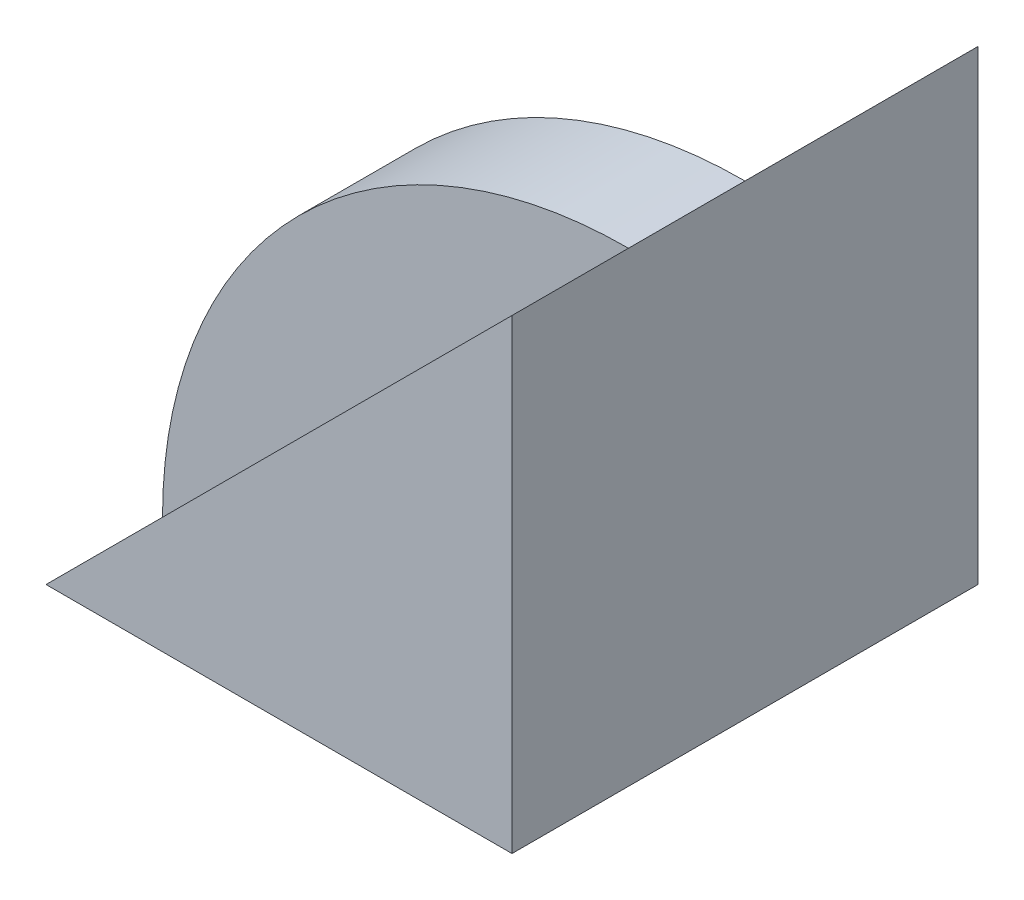
ISO-10303-21;
HEADER;
FILE_DESCRIPTION(('STEP AP214'),'2;1');
FILE_NAME('part.step','',(''),(''),'','','');
FILE_SCHEMA(('AUTOMOTIVE_DESIGN { 1 0 10303 214 1 1 1 1 }'));
ENDSEC;
DATA;
#1=APPLICATION_CONTEXT('core data for automotive mechanical design processes');
#2=APPLICATION_PROTOCOL_DEFINITION('international standard','automotive_design',2000,#1);
#3=PRODUCT_CONTEXT('',#1,'mechanical');
#4=PRODUCT('Part','Part','',(#3));
#5=PRODUCT_RELATED_PRODUCT_CATEGORY('part','',(#4));
#6=PRODUCT_DEFINITION_FORMATION('','',#4);
#7=PRODUCT_DEFINITION_CONTEXT('part definition',#1,'design');
#8=PRODUCT_DEFINITION('design','',#6,#7);
#9=PRODUCT_DEFINITION_SHAPE('','',#8);
#10=(LENGTH_UNIT() NAMED_UNIT(*) SI_UNIT(.MILLI.,.METRE.));
#11=(NAMED_UNIT(*) PLANE_ANGLE_UNIT() SI_UNIT($,.RADIAN.));
#12=(NAMED_UNIT(*) SI_UNIT($,.STERADIAN.) SOLID_ANGLE_UNIT());
#13=UNCERTAINTY_MEASURE_WITH_UNIT(LENGTH_MEASURE(1.E-05),#10,'distance_accuracy_value','');
#14=(GEOMETRIC_REPRESENTATION_CONTEXT(3) GLOBAL_UNCERTAINTY_ASSIGNED_CONTEXT((#13)) GLOBAL_UNIT_ASSIGNED_CONTEXT((#10,
#11,#12)) REPRESENTATION_CONTEXT('',''));
#15=CARTESIAN_POINT('',(0.,0.,0.));
#16=DIRECTION('',(0.,0.,1.));
#17=DIRECTION('',(1.,0.,0.));
#18=AXIS2_PLACEMENT_3D('',#15,#16,#17);
#19=CARTESIAN_POINT('',(0.,40.,10.));
#20=DIRECTION('',(-1.,0.,0.));
#21=DIRECTION('',(0.,-1.,0.));
#22=AXIS2_PLACEMENT_3D('',#19,#20,#21);
#23=PLANE('',#22);
#24=DIRECTION('',(0.,0.,-1.));
#25=VECTOR('',#24,1.);
#26=CARTESIAN_POINT('',(0.,0.,10.));
#27=LINE('',#26,#25);
#28=CARTESIAN_POINT('',(0.,0.,10.));
#29=VERTEX_POINT('',#28);
#30=CARTESIAN_POINT('',(0.,0.,-30.));
#31=VERTEX_POINT('',#30);
#32=EDGE_CURVE('E87',#29,#31,#27,.T.);
#33=ORIENTED_EDGE('',*,*,#32,.T.);
#34=DIRECTION('',(0.,-1.,0.));
#35=VECTOR('',#34,1.);
#36=CARTESIAN_POINT('',(1.39659253553725E-13,40.,-30.));
#37=LINE('',#36,#35);
#38=CARTESIAN_POINT('',(1.39659253553725E-13,40.,-30.));
#39=VERTEX_POINT('',#38);
#40=EDGE_CURVE('E71',#39,#31,#37,.T.);
#41=ORIENTED_EDGE('',*,*,#40,.F.);
#42=DIRECTION('',(0.,0.,1.));
#43=VECTOR('',#42,1.);
#44=CARTESIAN_POINT('',(1.39659253553725E-13,40.,-30.));
#45=LINE('',#44,#43);
#46=CARTESIAN_POINT('',(1.39659253553725E-13,40.,-10.));
#47=VERTEX_POINT('',#46);
#48=EDGE_CURVE('E81',#39,#47,#45,.T.);
#49=ORIENTED_EDGE('',*,*,#48,.T.);
#50=DIRECTION('',(0.,0.,1.));
#51=VECTOR('',#50,1.);
#52=CARTESIAN_POINT('',(0.,40.,-10.));
#53=LINE('',#52,#51);
#54=CARTESIAN_POINT('',(0.,40.,0.));
#55=VERTEX_POINT('',#54);
#56=EDGE_CURVE('E105',#47,#55,#53,.T.);
#57=ORIENTED_EDGE('',*,*,#56,.T.);
#58=DIRECTION('',(0.,0.,-1.));
#59=VECTOR('',#58,1.);
#60=CARTESIAN_POINT('',(0.,40.,10.));
#61=LINE('',#60,#59);
#62=CARTESIAN_POINT('',(0.,40.,10.));
#63=VERTEX_POINT('',#62);
#64=EDGE_CURVE('E11',#63,#55,#61,.T.);
#65=ORIENTED_EDGE('',*,*,#64,.F.);
#66=DIRECTION('',(0.,1.,0.));
#67=VECTOR('',#66,1.);
#68=CARTESIAN_POINT('',(0.,40.,10.));
#69=LINE('',#68,#67);
#70=EDGE_CURVE('E94',#29,#63,#69,.T.);
#71=ORIENTED_EDGE('',*,*,#70,.F.);
#72=EDGE_LOOP('',(#33,#41,#49,#57,#65,#71));
#73=FACE_BOUND('',#72,.T.);
#74=ADVANCED_FACE('F33',(#73),#23,.F.);
#75=CARTESIAN_POINT('',(-40.,0.,10.));
#76=DIRECTION('',(0.707106781186548,-0.707106781186548,0.));
#77=DIRECTION('',(0.707106781186548,0.707106781186548,0.));
#78=AXIS2_PLACEMENT_3D('',#75,#76,#77);
#79=PLANE('',#78);
#80=DIRECTION('',(-0.707106781186548,-0.707106781186548,0.));
#81=VECTOR('',#80,1.);
#82=CARTESIAN_POINT('',(-40.,0.,0.));
#83=LINE('',#82,#81);
#84=CARTESIAN_POINT('',(-40.,0.,0.));
#85=VERTEX_POINT('',#84);
#86=EDGE_CURVE('E99',#55,#85,#83,.T.);
#87=ORIENTED_EDGE('',*,*,#86,.T.);
#88=DIRECTION('',(0.,0.,-1.));
#89=VECTOR('',#88,1.);
#90=CARTESIAN_POINT('',(-40.,0.,10.));
#91=LINE('',#90,#89);
#92=CARTESIAN_POINT('',(-40.,0.,10.));
#93=VERTEX_POINT('',#92);
#94=EDGE_CURVE('E41',#93,#85,#91,.T.);
#95=ORIENTED_EDGE('',*,*,#94,.F.);
#96=DIRECTION('',(-0.707106781186548,-0.707106781186548,0.));
#97=VECTOR('',#96,1.);
#98=CARTESIAN_POINT('',(-40.,0.,10.));
#99=LINE('',#98,#97);
#100=EDGE_CURVE('E96',#63,#93,#99,.T.);
#101=ORIENTED_EDGE('',*,*,#100,.F.);
#102=ORIENTED_EDGE('',*,*,#64,.T.);
#103=EDGE_LOOP('',(#87,#95,#101,#102));
#104=FACE_BOUND('',#103,.T.);
#105=ADVANCED_FACE('F127',(#104),#79,.F.);
#106=CARTESIAN_POINT('',(0.,0.,10.));
#107=DIRECTION('',(0.,1.,0.));
#108=DIRECTION('',(0.,0.,1.));
#109=AXIS2_PLACEMENT_3D('',#106,#107,#108);
#110=PLANE('',#109);
#111=DIRECTION('',(0.,0.,1.));
#112=VECTOR('',#111,1.);
#113=CARTESIAN_POINT('',(-40.,0.,-10.));
#114=LINE('',#113,#112);
#115=CARTESIAN_POINT('',(-40.,0.,-10.));
#116=VERTEX_POINT('',#115);
#117=EDGE_CURVE('E91',#116,#85,#114,.T.);
#118=ORIENTED_EDGE('',*,*,#117,.F.);
#119=DIRECTION('',(-0.894427190999916,0.,0.447213595499958));
#120=VECTOR('',#119,1.);
#121=CARTESIAN_POINT('',(0.,0.,-30.));
#122=LINE('',#121,#120);
#123=EDGE_CURVE('E74',#31,#116,#122,.T.);
#124=ORIENTED_EDGE('',*,*,#123,.F.);
#125=ORIENTED_EDGE('',*,*,#32,.F.);
#126=DIRECTION('',(1.,0.,0.));
#127=VECTOR('',#126,1.);
#128=CARTESIAN_POINT('',(0.,0.,10.));
#129=LINE('',#128,#127);
#130=EDGE_CURVE('E48',#93,#29,#129,.T.);
#131=ORIENTED_EDGE('',*,*,#130,.F.);
#132=ORIENTED_EDGE('',*,*,#94,.T.);
#133=EDGE_LOOP('',(#118,#124,#125,#131,#132));
#134=FACE_BOUND('',#133,.T.);
#135=ADVANCED_FACE('F86',(#134),#110,.F.);
#136=CARTESIAN_POINT('',(0.,0.,10.));
#137=DIRECTION('',(0.,0.,-1.));
#138=DIRECTION('',(-1.,0.,0.));
#139=AXIS2_PLACEMENT_3D('',#136,#137,#138);
#140=PLANE('',#139);
#141=ORIENTED_EDGE('',*,*,#70,.T.);
#142=ORIENTED_EDGE('',*,*,#100,.T.);
#143=ORIENTED_EDGE('',*,*,#130,.T.);
#144=EDGE_LOOP('',(#141,#142,#143));
#145=FACE_BOUND('',#144,.T.);
#146=ADVANCED_FACE('F129',(#145),#140,.F.);
#147=CARTESIAN_POINT('',(0.,0.,-10.));
#148=DIRECTION('',(0.,0.,1.));
#149=DIRECTION('',(1.,0.,0.));
#150=AXIS2_PLACEMENT_3D('',#147,#148,#149);
#151=CYLINDRICAL_SURFACE('',#150,40.);
#152=CARTESIAN_POINT('',(0.,0.,0.));
#153=DIRECTION('',(0.,0.,-1.));
#154=DIRECTION('',(-1.,0.,0.));
#155=AXIS2_PLACEMENT_3D('',#152,#153,#154);
#156=CIRCLE('',#155,40.);
#157=EDGE_CURVE('E109',#85,#55,#156,.T.);
#158=ORIENTED_EDGE('',*,*,#157,.T.);
#159=ORIENTED_EDGE('',*,*,#56,.F.);
#160=CARTESIAN_POINT('',(0.,0.,-10.));
#161=DIRECTION('',(0.,0.,-1.));
#162=DIRECTION('',(-1.,0.,0.));
#163=AXIS2_PLACEMENT_3D('',#160,#161,#162);
#164=CIRCLE('',#163,40.);
#165=EDGE_CURVE('E108',#116,#47,#164,.T.);
#166=ORIENTED_EDGE('',*,*,#165,.F.);
#167=ORIENTED_EDGE('',*,*,#117,.T.);
#168=EDGE_LOOP('',(#158,#159,#166,#167));
#169=FACE_BOUND('',#168,.T.);
#170=ADVANCED_FACE('F124',(#169),#151,.T.);
#171=CARTESIAN_POINT('',(0.,0.,-10.));
#172=DIRECTION('',(0.,0.,-1.));
#173=DIRECTION('',(-1.,0.,0.));
#174=AXIS2_PLACEMENT_3D('',#171,#172,#173);
#175=PLANE('',#174);
#176=DIRECTION('',(0.707106781186549,0.707106781186546,0.));
#177=VECTOR('',#176,1.);
#178=CARTESIAN_POINT('',(-40.,0.,-10.));
#179=LINE('',#178,#177);
#180=EDGE_CURVE('E82',#116,#47,#179,.T.);
#181=ORIENTED_EDGE('',*,*,#180,.F.);
#182=ORIENTED_EDGE('',*,*,#165,.T.);
#183=EDGE_LOOP('',(#181,#182));
#184=FACE_BOUND('',#183,.T.);
#185=ADVANCED_FACE('F122',(#184),#175,.T.);
#186=CARTESIAN_POINT('',(0.,0.,0.));
#187=DIRECTION('',(0.,0.,-1.));
#188=DIRECTION('',(-1.,0.,0.));
#189=AXIS2_PLACEMENT_3D('',#186,#187,#188);
#190=PLANE('',#189);
#191=ORIENTED_EDGE('',*,*,#86,.F.);
#192=ORIENTED_EDGE('',*,*,#157,.F.);
#193=EDGE_LOOP('',(#191,#192));
#194=FACE_BOUND('',#193,.T.);
#195=ADVANCED_FACE('F168',(#194),#190,.F.);
#196=CARTESIAN_POINT('',(-40.,0.,-30.));
#197=DIRECTION('',(0.707106781186546,-0.707106781186549,0.));
#198=DIRECTION('',(0.707106781186549,0.707106781186546,0.));
#199=AXIS2_PLACEMENT_3D('',#196,#197,#198);
#200=PLANE('',#199);
#201=ORIENTED_EDGE('',*,*,#48,.F.);
#202=DIRECTION('',(-0.666666666666668,-0.666666666666666,0.333333333333334));
#203=VECTOR('',#202,1.);
#204=CARTESIAN_POINT('',(-35.5555555555556,4.44444444444444,-12.2222222222222));
#205=LINE('',#204,#203);
#206=EDGE_CURVE('E76',#39,#116,#205,.T.);
#207=ORIENTED_EDGE('',*,*,#206,.T.);
#208=ORIENTED_EDGE('',*,*,#180,.T.);
#209=EDGE_LOOP('',(#201,#207,#208));
#210=FACE_BOUND('',#209,.T.);
#211=ADVANCED_FACE('F119',(#210),#200,.F.);
#212=CARTESIAN_POINT('',(0.,57.,-30.));
#213=DIRECTION('',(0.447213595499958,0.,0.894427190999916));
#214=DIRECTION('',(0.894427190999916,0.,-0.447213595499958));
#215=AXIS2_PLACEMENT_3D('',#212,#213,#214);
#216=PLANE('',#215);
#217=ORIENTED_EDGE('',*,*,#40,.T.);
#218=ORIENTED_EDGE('',*,*,#123,.T.);
#219=ORIENTED_EDGE('',*,*,#206,.F.);
#220=EDGE_LOOP('',(#217,#218,#219));
#221=FACE_BOUND('',#220,.T.);
#222=ADVANCED_FACE('F73',(#221),#216,.F.);
#223=CLOSED_SHELL('',(#74,#105,#135,#146,#170,#185,#195,#211,#222));
#224=MANIFOLD_SOLID_BREP('B2',#223);
#225=ADVANCED_BREP_SHAPE_REPRESENTATION('',(#18,#224),#14);
#226=SHAPE_DEFINITION_REPRESENTATION(#9,#225);
ENDSEC;
END-ISO-10303-21;
